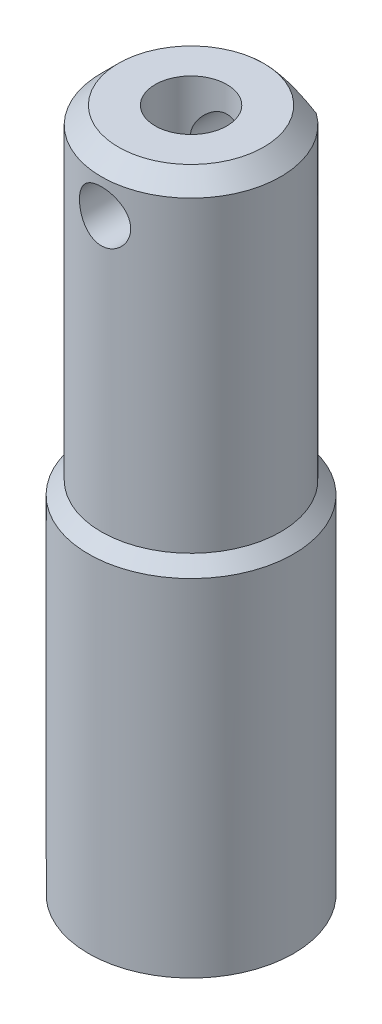
ISO-10303-21;
HEADER;
FILE_DESCRIPTION(('STEP AP214'),'2;1');
FILE_NAME('part.step','',(''),(''),'','','');
FILE_SCHEMA(('AUTOMOTIVE_DESIGN { 1 0 10303 214 1 1 1 1 }'));
ENDSEC;
DATA;
#1=APPLICATION_CONTEXT('core data for automotive mechanical design processes');
#2=APPLICATION_PROTOCOL_DEFINITION('international standard','automotive_design',2000,#1);
#3=PRODUCT_CONTEXT('',#1,'mechanical');
#4=PRODUCT('Part','Part','',(#3));
#5=PRODUCT_RELATED_PRODUCT_CATEGORY('part','',(#4));
#6=PRODUCT_DEFINITION_FORMATION('','',#4);
#7=PRODUCT_DEFINITION_CONTEXT('part definition',#1,'design');
#8=PRODUCT_DEFINITION('design','',#6,#7);
#9=PRODUCT_DEFINITION_SHAPE('','',#8);
#10=(LENGTH_UNIT() NAMED_UNIT(*) SI_UNIT(.MILLI.,.METRE.));
#11=(NAMED_UNIT(*) PLANE_ANGLE_UNIT() SI_UNIT($,.RADIAN.));
#12=(NAMED_UNIT(*) SI_UNIT($,.STERADIAN.) SOLID_ANGLE_UNIT());
#13=UNCERTAINTY_MEASURE_WITH_UNIT(LENGTH_MEASURE(1.E-05),#10,'distance_accuracy_value','');
#14=(GEOMETRIC_REPRESENTATION_CONTEXT(3) GLOBAL_UNCERTAINTY_ASSIGNED_CONTEXT((#13)) GLOBAL_UNIT_ASSIGNED_CONTEXT((#10,
#11,#12)) REPRESENTATION_CONTEXT('',''));
#15=CARTESIAN_POINT('',(0.,0.,0.));
#16=DIRECTION('',(0.,0.,1.));
#17=DIRECTION('',(1.,0.,0.));
#18=AXIS2_PLACEMENT_3D('',#15,#16,#17);
#19=CARTESIAN_POINT('',(0.,20.,0.));
#20=DIRECTION('',(0.,-1.,0.));
#21=DIRECTION('',(0.,0.,-1.));
#22=AXIS2_PLACEMENT_3D('',#19,#20,#21);
#23=CYLINDRICAL_SURFACE('',#22,6.);
#24=CARTESIAN_POINT('',(0.,20.25,0.));
#25=DIRECTION('',(0.,-1.,0.));
#26=DIRECTION('',(0.,0.,-1.));
#27=AXIS2_PLACEMENT_3D('',#24,#25,#26);
#28=CIRCLE('',#27,6.);
#29=CARTESIAN_POINT('',(0.,20.25,-6.));
#30=VERTEX_POINT('',#29);
#31=EDGE_CURVE('E11',#30,#30,#28,.T.);
#32=ORIENTED_EDGE('',*,*,#31,.T.);
#33=EDGE_LOOP('',(#32));
#34=FACE_BOUND('',#33,.T.);
#35=CARTESIAN_POINT('',(0.,0.,0.));
#36=DIRECTION('',(0.,1.,0.));
#37=DIRECTION('',(0.,0.,1.));
#38=AXIS2_PLACEMENT_3D('',#35,#36,#37);
#39=CIRCLE('',#38,6.);
#40=CARTESIAN_POINT('',(0.,0.,6.));
#41=VERTEX_POINT('',#40);
#42=EDGE_CURVE('E94',#41,#41,#39,.T.);
#43=ORIENTED_EDGE('',*,*,#42,.T.);
#44=EDGE_LOOP('',(#43));
#45=FACE_BOUND('',#44,.T.);
#46=ADVANCED_FACE('F36',(#34,#45),#23,.T.);
#47=CARTESIAN_POINT('',(0.,0.,0.));
#48=DIRECTION('',(0.,1.,0.));
#49=DIRECTION('',(0.,0.,1.));
#50=AXIS2_PLACEMENT_3D('',#47,#48,#49);
#51=PLANE('',#50);
#52=ORIENTED_EDGE('',*,*,#42,.F.);
#53=EDGE_LOOP('',(#52));
#54=FACE_BOUND('',#53,.T.);
#55=ADVANCED_FACE('F131',(#54),#51,.F.);
#56=CARTESIAN_POINT('',(0.,40.,0.));
#57=DIRECTION('',(0.,-1.,0.));
#58=DIRECTION('',(0.,0.,-1.));
#59=AXIS2_PLACEMENT_3D('',#56,#57,#58);
#60=CYLINDRICAL_SURFACE('',#59,5.25);
#61=CARTESIAN_POINT('',(0.,21.,0.));
#62=DIRECTION('',(0.,1.,0.));
#63=DIRECTION('',(0.,0.,1.));
#64=AXIS2_PLACEMENT_3D('',#61,#62,#63);
#65=CIRCLE('',#64,5.25);
#66=CARTESIAN_POINT('',(0.,21.,5.25));
#67=VERTEX_POINT('',#66);
#68=EDGE_CURVE('E153',#67,#67,#65,.T.);
#69=ORIENTED_EDGE('',*,*,#68,.T.);
#70=EDGE_LOOP('',(#69));
#71=FACE_BOUND('',#70,.T.);
#72=CARTESIAN_POINT('',(-1.5,37.,5.03115294937453));
#73=CARTESIAN_POINT('',(-1.49999851534795,37.0823886534079,5.03115410257281));
#74=CARTESIAN_POINT('',(-1.49318899949663,37.1647923131909,5.03319884759406));
#75=CARTESIAN_POINT('',(-1.46619272542646,37.3272034291472,5.04112791905326));
#76=CARTESIAN_POINT('',(-1.44600052602251,37.4072098968255,5.04701380722367));
#77=CARTESIAN_POINT('',(-1.3929700746965,37.5624529006536,5.06190532141159));
#78=CARTESIAN_POINT('',(-1.36015140488906,37.6376966138629,5.07090611443027));
#79=CARTESIAN_POINT('',(-1.28286273047203,37.7816258586658,5.09100690822109));
#80=CARTESIAN_POINT('',(-1.2383913424976,37.8503106102835,5.10210715818895));
#81=CARTESIAN_POINT('',(-1.13769360073649,37.9811436739861,5.12551337410616));
#82=CARTESIAN_POINT('',(-1.08119190834937,38.0430758515969,5.13784316973112));
#83=CARTESIAN_POINT('',(-0.958628434101954,38.1567270874778,5.16211474134013));
#84=CARTESIAN_POINT('',(-0.892565534369724,38.2084449498421,5.17405647175239));
#85=CARTESIAN_POINT('',(-0.751234524118192,38.3011214862651,5.19647499001134));
#86=CARTESIAN_POINT('',(-0.675818087821402,38.3418622148132,5.2069204087565));
#87=CARTESIAN_POINT('',(-0.518856356429732,38.410001330812,5.22489405364148));
#88=CARTESIAN_POINT('',(-0.437312258156382,38.4374023159302,5.23242284768149));
#89=CARTESIAN_POINT('',(-0.272668931340886,38.4773758459298,5.24354639475177));
#90=CARTESIAN_POINT('',(-0.189665848596783,38.4903167662785,5.24723870258477));
#91=CARTESIAN_POINT('',(-0.0225900768164462,38.5021650504124,5.2506157174477));
#92=CARTESIAN_POINT('',(0.0614824046914079,38.501075096753,5.25030119054237));
#93=CARTESIAN_POINT('',(0.225735146801412,38.4851452188115,5.2457700507248));
#94=CARTESIAN_POINT('',(0.305957659581706,38.4707037905215,5.24166653082038));
#95=CARTESIAN_POINT('',(0.46278916663321,38.4291286731517,5.23015414747603));
#96=CARTESIAN_POINT('',(0.539397940725379,38.4019942118034,5.22274508292168));
#97=CARTESIAN_POINT('',(0.687805375296692,38.3355179493911,5.20529273829083));
#98=CARTESIAN_POINT('',(0.759542282888079,38.2960459166437,5.195221541341));
#99=CARTESIAN_POINT('',(0.895505432692863,38.2061165602015,5.17352076730531));
#100=CARTESIAN_POINT('',(0.959730024312008,38.1556568292501,5.16189084893963));
#101=CARTESIAN_POINT('',(1.08122448641081,38.0430957170361,5.13784262264717));
#102=CARTESIAN_POINT('',(1.13817118318867,37.9806479247962,5.1254109702704));
#103=CARTESIAN_POINT('',(1.24086976181232,37.8469636811155,5.10152230340244));
#104=CARTESIAN_POINT('',(1.28662073533696,37.7757265172882,5.09006536804024));
#105=CARTESIAN_POINT('',(1.36592501989085,37.6257018366265,5.06936381110807));
#106=CARTESIAN_POINT('',(1.39937803341578,37.5468585812113,5.06013758203982));
#107=CARTESIAN_POINT('',(1.45244213622068,37.3843351273715,5.04516408290506));
#108=CARTESIAN_POINT('',(1.47205725302032,37.3006563440051,5.03941580065156));
#109=CARTESIAN_POINT('',(1.49630562899914,37.1338896817508,5.03226836397145));
#110=CARTESIAN_POINT('',(1.50142611118016,37.0508786373002,5.03072783487502));
#111=CARTESIAN_POINT('',(1.49789247539749,36.8851837630593,5.0317811969763));
#112=CARTESIAN_POINT('',(1.48924007568482,36.8024998937418,5.03437457244426));
#113=CARTESIAN_POINT('',(1.45883836069446,36.6417690789828,5.04326572540292));
#114=CARTESIAN_POINT('',(1.43739346638105,36.5636593104886,5.04947732224089));
#115=CARTESIAN_POINT('',(1.38236371399822,36.4121485960017,5.06481797948048));
#116=CARTESIAN_POINT('',(1.34877710420076,36.3387483312658,5.07394746083355));
#117=CARTESIAN_POINT('',(1.26946473841218,36.1967334435874,5.09437641007042));
#118=CARTESIAN_POINT('',(1.22345918796849,36.1282821668484,5.10572398035841));
#119=CARTESIAN_POINT('',(1.12095347763631,35.9998927199175,5.12920294912374));
#120=CARTESIAN_POINT('',(1.06445104326103,35.9399563997409,5.14133451710708));
#121=CARTESIAN_POINT('',(0.940281007474169,35.8282154362839,5.16551045577065));
#122=CARTESIAN_POINT('',(0.872300782680413,35.7767537714359,5.17753804534607));
#123=CARTESIAN_POINT('',(0.72838898029316,35.685965738963,5.19973482784499));
#124=CARTESIAN_POINT('',(0.652457818573638,35.6466387370582,5.20990411789059));
#125=CARTESIAN_POINT('',(0.495324954717124,35.5816117847302,5.22717378634804));
#126=CARTESIAN_POINT('',(0.414168599924726,35.5558087078104,5.23429731095436));
#127=CARTESIAN_POINT('',(0.248434236412442,35.5182798985449,5.24477504717914));
#128=CARTESIAN_POINT('',(0.163857113689078,35.506550544864,5.24813022842264));
#129=CARTESIAN_POINT('',(-0.00313367846927184,35.4977564245017,5.25064001252463));
#130=CARTESIAN_POINT('',(-0.0855192232874674,35.5001918881879,5.24993777691747));
#131=CARTESIAN_POINT('',(-0.248658879316503,35.5184787110577,5.24474301841601));
#132=CARTESIAN_POINT('',(-0.329413068463148,35.5343294277865,5.24025067702944));
#133=CARTESIAN_POINT('',(-0.48630309977969,35.5786985207341,5.22801601395087));
#134=CARTESIAN_POINT('',(-0.562473775076287,35.607102384208,5.22030310536131));
#135=CARTESIAN_POINT('',(-0.709010402071097,35.6756696187141,5.2024282060759));
#136=CARTESIAN_POINT('',(-0.779375452935512,35.7158348103192,5.19226583626338));
#137=CARTESIAN_POINT('',(-0.914575092265432,35.8081730030686,5.17019216580141));
#138=CARTESIAN_POINT('',(-0.979182996005302,35.8606675650913,5.15823784339672));
#139=CARTESIAN_POINT('',(-1.09884091673879,35.9755818440904,5.13408048739897));
#140=CARTESIAN_POINT('',(-1.15388828414235,36.0380043033136,5.12187738590337));
#141=CARTESIAN_POINT('',(-1.25430634521844,36.1729726877466,5.09823028157902));
#142=CARTESIAN_POINT('',(-1.29938487542695,36.2457414606276,5.08681463826367));
#143=CARTESIAN_POINT('',(-1.37660957714715,36.398141398986,5.0664633399873));
#144=CARTESIAN_POINT('',(-1.40876298663645,36.4777686933162,5.05752629789876));
#145=CARTESIAN_POINT('',(-1.45573900509351,36.6307402751745,5.04418844667444));
#146=CARTESIAN_POINT('',(-1.47229424986293,36.7035177610769,5.03934329125492));
#147=CARTESIAN_POINT('',(-1.49442455282772,36.8508595887639,5.03282527099894));
#148=CARTESIAN_POINT('',(-1.5000013438736,36.9254236466733,5.03115190552541));
#149=CARTESIAN_POINT('',(-1.5,37.,5.03115294937453));
#150=B_SPLINE_CURVE_WITH_KNOTS('',3,(#72,#73,#74,#75,#76,#77,#78,#79,#80,#81,#82,#83,#84,#85,
#86,#87,#88,#89,#90,#91,#92,#93,#94,#95,#96,#97,#98,#99,#100,#101,#102,#103,#104,#105,#106,#107,
#108,#109,#110,#111,#112,#113,#114,#115,#116,#117,#118,#119,#120,#121,#122,#123,#124,#125,#126,
#127,#128,#129,#130,#131,#132,#133,#134,#135,#136,#137,#138,#139,#140,#141,#142,#143,#144,#145,
#146,#147,#148,#149),.UNSPECIFIED.,.T.,.F.,(4,2,2,2,2,2,2,2,2,2,2,2,2,2,2,2,2,2,2,2,2,2,2,2,2,2,
2,2,2,2,2,2,2,2,2,2,2,2,4),(0.,0.24689125677296,0.493882957214146,0.740493137802328,
0.987132608255508,1.24017875404962,1.49325450928863,1.75103612260385,2.00876751763279,
2.25977175771556,2.51072800914313,2.75442778232566,2.99814238459891,3.24452177533869,
3.49095519888626,3.7460370951975,4.0011396797232,4.25827890472505,4.51534325844759,
4.76365772500111,5.01194121523837,5.25453967242384,5.49717314412031,5.74581004531786,
5.99450088465078,6.25159041282492,6.50866650063486,6.76375263973567,7.01877312807479,
7.26485173263045,7.51091855317931,7.75478559291908,7.99869040157418,8.24984826559029,
8.50107562436486,8.7589020931598,9.01658397911739,9.2400996664987,9.46358007110251),.UNSPECIFIED.);
#151=CARTESIAN_POINT('',(-1.5,37.,5.03115294937453));
#152=VERTEX_POINT('',#151);
#153=EDGE_CURVE('E85',#152,#152,#150,.T.);
#154=ORIENTED_EDGE('',*,*,#153,.T.);
#155=EDGE_LOOP('',(#154));
#156=FACE_BOUND('',#155,.T.);
#157=DIRECTION('',(0.,1.,0.));
#158=VECTOR('',#157,1.);
#159=CARTESIAN_POINT('',(3.08220700148449,28.,-4.25));
#160=LINE('',#159,#158);
#161=CARTESIAN_POINT('',(3.08220700148449,28.,-4.25));
#162=VERTEX_POINT('',#161);
#163=CARTESIAN_POINT('',(3.08220700148449,39.,-4.25));
#164=VERTEX_POINT('',#163);
#165=EDGE_CURVE('E92',#162,#164,#160,.T.);
#166=ORIENTED_EDGE('',*,*,#165,.T.);
#167=CARTESIAN_POINT('',(0.,39.,0.));
#168=DIRECTION('',(0.,1.,0.));
#169=DIRECTION('',(0.,0.,1.));
#170=AXIS2_PLACEMENT_3D('',#167,#168,#169);
#171=CIRCLE('',#170,5.25);
#172=CARTESIAN_POINT('',(-3.08220700148449,39.,-4.25));
#173=VERTEX_POINT('',#172);
#174=EDGE_CURVE('E44',#164,#173,#171,.F.);
#175=ORIENTED_EDGE('',*,*,#174,.T.);
#176=DIRECTION('',(0.,1.,0.));
#177=VECTOR('',#176,1.);
#178=CARTESIAN_POINT('',(-3.08220700148449,28.,-4.25));
#179=LINE('',#178,#177);
#180=CARTESIAN_POINT('',(-3.08220700148449,28.,-4.25));
#181=VERTEX_POINT('',#180);
#182=EDGE_CURVE('E91',#181,#173,#179,.T.);
#183=ORIENTED_EDGE('',*,*,#182,.F.);
#184=CARTESIAN_POINT('',(0.,28.,0.));
#185=DIRECTION('',(0.,1.,0.));
#186=DIRECTION('',(0.,0.,1.));
#187=AXIS2_PLACEMENT_3D('',#184,#185,#186);
#188=CIRCLE('',#187,5.25);
#189=EDGE_CURVE('E79',#162,#181,#188,.T.);
#190=ORIENTED_EDGE('',*,*,#189,.F.);
#191=EDGE_LOOP('',(#166,#175,#183,#190));
#192=FACE_BOUND('',#191,.T.);
#193=ADVANCED_FACE('F125',(#71,#156,#192),#60,.T.);
#194=CARTESIAN_POINT('',(0.,40.,0.));
#195=DIRECTION('',(0.,1.,0.));
#196=DIRECTION('',(0.,0.,1.));
#197=AXIS2_PLACEMENT_3D('',#194,#195,#196);
#198=PLANE('',#197);
#199=CARTESIAN_POINT('',(0.,40.,0.));
#200=DIRECTION('',(0.,1.,0.));
#201=DIRECTION('',(0.,0.,1.));
#202=AXIS2_PLACEMENT_3D('',#199,#200,#201);
#203=CIRCLE('',#202,4.25);
#204=CARTESIAN_POINT('',(0.,40.,-4.25));
#205=VERTEX_POINT('',#204);
#206=EDGE_CURVE('E98',#205,#205,#203,.T.);
#207=ORIENTED_EDGE('',*,*,#206,.T.);
#208=EDGE_LOOP('',(#207));
#209=FACE_BOUND('',#208,.T.);
#210=CARTESIAN_POINT('',(0.,40.,0.));
#211=DIRECTION('',(0.,1.,0.));
#212=DIRECTION('',(0.,0.,1.));
#213=AXIS2_PLACEMENT_3D('',#210,#211,#212);
#214=CIRCLE('',#213,2.1);
#215=CARTESIAN_POINT('',(0.,40.,2.1));
#216=VERTEX_POINT('',#215);
#217=EDGE_CURVE('E80',#216,#216,#214,.T.);
#218=ORIENTED_EDGE('',*,*,#217,.F.);
#219=EDGE_LOOP('',(#218));
#220=FACE_BOUND('',#219,.T.);
#221=ADVANCED_FACE('F130',(#209,#220),#198,.T.);
#222=CARTESIAN_POINT('',(-3.08220700148449,28.,-4.25));
#223=DIRECTION('',(0.,0.,1.));
#224=DIRECTION('',(1.,0.,0.));
#225=AXIS2_PLACEMENT_3D('',#222,#223,#224);
#226=PLANE('',#225);
#227=CARTESIAN_POINT('',(0.,37.,-4.25));
#228=DIRECTION('',(0.,0.,-1.));
#229=DIRECTION('',(-1.,0.,0.));
#230=AXIS2_PLACEMENT_3D('',#227,#228,#229);
#231=CIRCLE('',#230,1.5);
#232=CARTESIAN_POINT('',(-1.5,37.,-4.25));
#233=VERTEX_POINT('',#232);
#234=EDGE_CURVE('E107',#233,#233,#231,.T.);
#235=ORIENTED_EDGE('',*,*,#234,.F.);
#236=EDGE_LOOP('',(#235));
#237=FACE_BOUND('',#236,.T.);
#238=CARTESIAN_POINT('',(-3.08220700148449,39.,-4.25));
#239=CARTESIAN_POINT('',(-3.0063701603359,39.0445182820328,-4.25));
#240=CARTESIAN_POINT('',(-2.93006831491126,39.0882422805079,-4.25));
#241=CARTESIAN_POINT('',(-2.77643153423641,39.1738799842041,-4.25));
#242=CARTESIAN_POINT('',(-2.69909634587394,39.2157932348397,-4.25));
#243=CARTESIAN_POINT('',(-2.46491445662935,39.3387288340163,-4.25));
#244=CARTESIAN_POINT('',(-2.30640522289687,39.4166415274033,-4.25));
#245=CARTESIAN_POINT('',(-1.98858259772944,39.5598661096746,-4.25));
#246=CARTESIAN_POINT('',(-1.82939182660505,39.6254477253803,-4.25));
#247=CARTESIAN_POINT('',(-1.50634651678711,39.7434433555469,-4.25));
#248=CARTESIAN_POINT('',(-1.34249911394454,39.7958764230781,-4.25));
#249=CARTESIAN_POINT('',(-1.08130436749482,39.8655618602511,-4.25));
#250=CARTESIAN_POINT('',(-0.985404512816414,39.8882803809539,-4.25));
#251=CARTESIAN_POINT('',(-0.792384764386069,39.9277956953645,-4.25));
#252=CARTESIAN_POINT('',(-0.695264960443363,39.944592922366,-4.25));
#253=CARTESIAN_POINT('',(-0.498745804538502,39.9719543557624,-4.25));
#254=CARTESIAN_POINT('',(-0.39933362024921,39.9824273238007,-4.25));
#255=CARTESIAN_POINT('',(-0.199954070272676,39.9964726533747,-4.25));
#256=CARTESIAN_POINT('',(-0.0999863562874619,40.0000400393217,-4.25));
#257=CARTESIAN_POINT('',(0.,40.,-4.25));
#258=B_SPLINE_CURVE_WITH_KNOTS('',3,(#238,#239,#240,#241,#242,#243,#244,#245,#246,#247,#248,
#249,#250,#251,#252,#253,#254,#255,#256,#257),.UNSPECIFIED.,.F.,.F.,(4,2,2,2,2,2,2,2,2,4),(0.,
0.263804043656459,0.527673934566439,1.05720503683108,1.57329018194224,2.08862310881886,
2.38412748876099,2.67961024053117,2.97925988548073,3.27912535282511),.UNSPECIFIED.);
#259=EDGE_CURVE('E144',#173,#205,#258,.T.);
#260=ORIENTED_EDGE('',*,*,#259,.T.);
#261=CARTESIAN_POINT('',(0.,40.,-4.25));
#262=CARTESIAN_POINT('',(0.0653269705590216,40.0000052576683,-4.25));
#263=CARTESIAN_POINT('',(0.13064423570968,39.9984930313468,-4.25));
#264=CARTESIAN_POINT('',(0.261131064735354,39.9924830596894,-4.25));
#265=CARTESIAN_POINT('',(0.326300650693151,39.9879857949662,-4.25));
#266=CARTESIAN_POINT('',(0.521152384573401,39.9701150445716,-4.25));
#267=CARTESIAN_POINT('',(0.650454355991038,39.9523621832319,-4.25));
#268=CARTESIAN_POINT('',(0.904956250359105,39.9064979173804,-4.25));
#269=CARTESIAN_POINT('',(1.03018865635995,39.8785621474672,-4.25));
#270=CARTESIAN_POINT('',(1.27828420427429,39.8135410018351,-4.25));
#271=CARTESIAN_POINT('',(1.40114635051383,39.7764518675709,-4.25));
#272=CARTESIAN_POINT('',(1.65777124024803,39.6898992993084,-4.25));
#273=CARTESIAN_POINT('',(1.79122132431231,39.6395170773918,-4.25));
#274=CARTESIAN_POINT('',(2.0548723678893,39.5308293023631,-4.25));
#275=CARTESIAN_POINT('',(2.1850722001696,39.4725210443658,-4.25));
#276=CARTESIAN_POINT('',(2.44490104728183,39.3482927252294,-4.25));
#277=CARTESIAN_POINT('',(2.57446884789548,39.2822458643508,-4.25));
#278=CARTESIAN_POINT('',(2.8305209965574,39.1448243310907,-4.25));
#279=CARTESIAN_POINT('',(2.95700945433946,39.0734573421309,-4.25));
#280=CARTESIAN_POINT('',(3.08220700148449,39.,-4.25));
#281=B_SPLINE_CURVE_WITH_KNOTS('',3,(#261,#262,#263,#264,#265,#266,#267,#268,#269,#270,#271,
#272,#273,#274,#275,#276,#277,#278,#279,#280),.UNSPECIFIED.,.F.,.F.,(4,2,2,2,2,2,2,2,2,4),(0.,
0.195944861766853,0.391858182651325,0.782857410641365,1.16740924493426,1.55211924700794,
1.97973894049338,2.40750493405806,2.84365579152382,3.27918852057569),.UNSPECIFIED.);
#282=EDGE_CURVE('E58',#205,#164,#281,.T.);
#283=ORIENTED_EDGE('',*,*,#282,.T.);
#284=ORIENTED_EDGE('',*,*,#165,.F.);
#285=DIRECTION('',(1.,0.,0.));
#286=VECTOR('',#285,1.);
#287=CARTESIAN_POINT('',(-3.08220700148449,28.,-4.25));
#288=LINE('',#287,#286);
#289=EDGE_CURVE('E82',#181,#162,#288,.T.);
#290=ORIENTED_EDGE('',*,*,#289,.F.);
#291=ORIENTED_EDGE('',*,*,#182,.T.);
#292=EDGE_LOOP('',(#260,#283,#284,#290,#291));
#293=FACE_BOUND('',#292,.T.);
#294=ADVANCED_FACE('F154',(#237,#293),#226,.F.);
#295=CARTESIAN_POINT('',(0.,28.,0.));
#296=DIRECTION('',(0.,1.,0.));
#297=DIRECTION('',(0.,0.,1.));
#298=AXIS2_PLACEMENT_3D('',#295,#296,#297);
#299=PLANE('',#298);
#300=ORIENTED_EDGE('',*,*,#189,.T.);
#301=ORIENTED_EDGE('',*,*,#289,.T.);
#302=EDGE_LOOP('',(#300,#301));
#303=FACE_BOUND('',#302,.T.);
#304=ADVANCED_FACE('F73',(#303),#299,.T.);
#305=CARTESIAN_POINT('',(0.,26.,0.));
#306=DIRECTION('',(0.,1.,0.));
#307=DIRECTION('',(0.,0.,1.));
#308=AXIS2_PLACEMENT_3D('',#305,#306,#307);
#309=CONICAL_SURFACE('',#308,2.1,1.02974425867665);
#310=CARTESIAN_POINT('',(0.,24.7381927000421,0.));
#311=VERTEX_POINT('',#310);
#312=VERTEX_LOOP('',#311);
#313=FACE_BOUND('',#312,.T.);
#314=CARTESIAN_POINT('',(0.,26.,0.));
#315=DIRECTION('',(0.,1.,0.));
#316=DIRECTION('',(0.,0.,1.));
#317=AXIS2_PLACEMENT_3D('',#314,#315,#316);
#318=CIRCLE('',#317,2.1);
#319=CARTESIAN_POINT('',(0.,26.,2.1));
#320=VERTEX_POINT('',#319);
#321=EDGE_CURVE('E77',#320,#320,#318,.T.);
#322=ORIENTED_EDGE('',*,*,#321,.T.);
#323=EDGE_LOOP('',(#322));
#324=FACE_BOUND('',#323,.T.);
#325=ADVANCED_FACE('F69',(#313,#324),#309,.F.);
#326=CARTESIAN_POINT('',(0.,40.,0.));
#327=DIRECTION('',(0.,1.,0.));
#328=DIRECTION('',(0.,0.,1.));
#329=AXIS2_PLACEMENT_3D('',#326,#327,#328);
#330=CYLINDRICAL_SURFACE('',#329,2.1);
#331=CARTESIAN_POINT('',(0.,35.5,2.1));
#332=CARTESIAN_POINT('',(0.074239987154313,35.4999983328154,2.10000151369632));
#333=CARTESIAN_POINT('',(0.148472287801961,35.5055423787794,2.0960305657222));
#334=CARTESIAN_POINT('',(0.294537510569104,35.5273475251038,2.0805400757946));
#335=CARTESIAN_POINT('',(0.366369374426851,35.5436132884446,2.06901724946753));
#336=CARTESIAN_POINT('',(0.505280759912231,35.585807308767,2.03953798236432));
#337=CARTESIAN_POINT('',(0.572382093189154,35.6116872220812,2.02161374748366));
#338=CARTESIAN_POINT('',(0.700940346431814,35.671945724954,1.98071681938223));
#339=CARTESIAN_POINT('',(0.762396508800773,35.7063254529312,1.95774344995381));
#340=CARTESIAN_POINT('',(0.884158454498676,35.7859073516989,1.90604858079968));
#341=CARTESIAN_POINT('',(0.943867292555758,35.8318033956452,1.87699641663021));
#342=CARTESIAN_POINT('',(1.05527082397682,35.9313580286347,1.81670725523486));
#343=CARTESIAN_POINT('',(1.10695327031244,35.9850282433377,1.78546702271466));
#344=CARTESIAN_POINT('',(1.21060137903401,36.1099438614266,1.71725277223226));
#345=CARTESIAN_POINT('',(1.26087106387615,36.1826062344538,1.6802808930462));
#346=CARTESIAN_POINT('',(1.34855873776776,36.3372329019045,1.61074875287382));
#347=CARTESIAN_POINT('',(1.38599721054951,36.4191820898905,1.57818151113001));
#348=CARTESIAN_POINT('',(1.43652136520738,36.5638355165509,1.53205163132705));
#349=CARTESIAN_POINT('',(1.45356662497443,36.6242701001125,1.51574445703128));
#350=CARTESIAN_POINT('',(1.48005230154604,36.7481312598627,1.48989690052004));
#351=CARTESIAN_POINT('',(1.48950884665266,36.8115511857637,1.48034217251357));
#352=CARTESIAN_POINT('',(1.50020552985074,36.9402391816524,1.46950664613977));
#353=CARTESIAN_POINT('',(1.50139229875544,37.0055165312642,1.46827959192339));
#354=CARTESIAN_POINT('',(1.49530198035969,37.1352791024719,1.47447819447096));
#355=CARTESIAN_POINT('',(1.48801790144054,37.1997636252687,1.48191099886764));
#356=CARTESIAN_POINT('',(1.46411936401694,37.3340474341866,1.50554403866107));
#357=CARTESIAN_POINT('',(1.44643072329693,37.4034716403027,1.52274402363615));
#358=CARTESIAN_POINT('',(1.4021917385744,37.5374588371673,1.56357256020827));
#359=CARTESIAN_POINT('',(1.37562175610307,37.6020106628682,1.58721533654268));
#360=CARTESIAN_POINT('',(1.30511742817235,37.7448735997179,1.64601588118791));
#361=CARTESIAN_POINT('',(1.25835357558366,37.8212487194466,1.68247147274397));
#362=CARTESIAN_POINT('',(1.15248477752395,37.9642087692087,1.7566939000375));
#363=CARTESIAN_POINT('',(1.09336770173585,38.0307839658066,1.79446199397487));
#364=CARTESIAN_POINT('',(0.962800834327982,38.1537461025634,1.86780118446223));
#365=CARTESIAN_POINT('',(0.891235370375016,38.2100263003869,1.90334699446249));
#366=CARTESIAN_POINT('',(0.737122627440586,38.3095868466926,1.96814501690765));
#367=CARTESIAN_POINT('',(0.654601115677314,38.3528969440433,1.99741158728469));
#368=CARTESIAN_POINT('',(0.502786762492044,38.4149591141148,2.04003552659874));
#369=CARTESIAN_POINT('',(0.435502933372752,38.4371586283004,2.05554723038274));
#370=CARTESIAN_POINT('',(0.297347607907097,38.4719529373133,2.08002166700399));
#371=CARTESIAN_POINT('',(0.22647875868259,38.4845547116779,2.08898915863501));
#372=CARTESIAN_POINT('',(0.082880813057716,38.4994521079923,2.09960209594908));
#373=CARTESIAN_POINT('',(0.010146545777707,38.5017150354395,2.10122431355104));
#374=CARTESIAN_POINT('',(-0.13466214450759,38.4956998283681,2.09692955045279));
#375=CARTESIAN_POINT('',(-0.206736496598432,38.4874205740719,2.09101176886313));
#376=CARTESIAN_POINT('',(-0.344652982451693,38.4614742561572,2.07263811534357));
#377=CARTESIAN_POINT('',(-0.410628443822311,38.4442731782697,2.06050712104556));
#378=CARTESIAN_POINT('',(-0.538540725972057,38.4016147128666,2.03083469907945));
#379=CARTESIAN_POINT('',(-0.600476724637231,38.3761556509397,2.0132921741901));
#380=CARTESIAN_POINT('',(-0.724729922862123,38.3152870706117,1.97216386451728));
#381=CARTESIAN_POINT('',(-0.786570692260161,38.2791837539811,1.94817387755704));
#382=CARTESIAN_POINT('',(-0.90357566486908,38.1994056236057,1.89674553679489));
#383=CARTESIAN_POINT('',(-0.958734635088287,38.1557249397661,1.86930451408401));
#384=CARTESIAN_POINT('',(-1.07130953790489,38.053139475002,1.80751918651238));
#385=CARTESIAN_POINT('',(-1.12732700599567,37.9929101524552,1.7728243678149));
#386=CARTESIAN_POINT('',(-1.22898063188699,37.8639189512719,1.7039290476612));
#387=CARTESIAN_POINT('',(-1.27461125255647,37.7951525516436,1.66972881892081));
#388=CARTESIAN_POINT('',(-1.34840655881999,37.6608502607182,1.61049068369464));
#389=CARTESIAN_POINT('',(-1.3781826574188,37.5964683129876,1.58485448207673));
#390=CARTESIAN_POINT('',(-1.42875227353067,37.4623595209991,1.5394240379246));
#391=CARTESIAN_POINT('',(-1.44956479313557,37.3926443561844,1.51961746555233));
#392=CARTESIAN_POINT('',(-1.47808233463791,37.2623907137056,1.49184341447737));
#393=CARTESIAN_POINT('',(-1.48750670349303,37.2025615644356,1.4823579407629));
#394=CARTESIAN_POINT('',(-1.49901279618901,37.0815181759182,1.47072540809102));
#395=CARTESIAN_POINT('',(-1.50110270525938,37.02030555748,1.46857016870271));
#396=CARTESIAN_POINT('',(-1.49779304937287,36.8983049277164,1.47194411498406));
#397=CARTESIAN_POINT('',(-1.49239297729272,36.8375169454218,1.47747382097746));
#398=CARTESIAN_POINT('',(-1.47449551867843,36.7179915614626,1.49533169466967));
#399=CARTESIAN_POINT('',(-1.46198715244103,36.6592574816607,1.50767037888344));
#400=CARTESIAN_POINT('',(-1.42521014636684,36.5255757861049,1.54259872476081));
#401=CARTESIAN_POINT('',(-1.39839283351164,36.4518773488908,1.56724515694173));
#402=CARTESIAN_POINT('',(-1.33469997861311,36.3111086032865,1.62183051991131));
#403=CARTESIAN_POINT('',(-1.2978077170184,36.2440495674089,1.65177821892023));
#404=CARTESIAN_POINT('',(-1.21375615645452,36.1152034119194,1.71453266330322));
#405=CARTESIAN_POINT('',(-1.1663473765118,36.0536066242369,1.74739464555718));
#406=CARTESIAN_POINT('',(-1.06240230609338,35.9382412767377,1.81247541609042));
#407=CARTESIAN_POINT('',(-1.00586287927557,35.884475418928,1.84469397906931));
#408=CARTESIAN_POINT('',(-0.873603136327677,35.7771946746661,1.91133354237187));
#409=CARTESIAN_POINT('',(-0.796256196228738,35.7252991560306,1.94518702963912));
#410=CARTESIAN_POINT('',(-0.630875696670561,35.6358952974295,2.00491356473176));
#411=CARTESIAN_POINT('',(-0.542860755389257,35.5983623541869,2.03080024477001));
#412=CARTESIAN_POINT('',(-0.379081513008413,35.5467359694778,2.06681366995399));
#413=CARTESIAN_POINT('',(-0.304852347827535,35.5293102628379,2.07914974133551));
#414=CARTESIAN_POINT('',(-0.153744270008503,35.505948741211,2.09573818287287));
#415=CARTESIAN_POINT('',(-0.0768680148396463,35.5000017262014,2.09999843272021));
#416=CARTESIAN_POINT('',(0.,35.5,2.1));
#417=B_SPLINE_CURVE_WITH_KNOTS('',3,(#331,#332,#333,#334,#335,#336,#337,#338,#339,#340,#341,
#342,#343,#344,#345,#346,#347,#348,#349,#350,#351,#352,#353,#354,#355,#356,#357,#358,#359,#360,
#361,#362,#363,#364,#365,#366,#367,#368,#369,#370,#371,#372,#373,#374,#375,#376,#377,#378,#379,
#380,#381,#382,#383,#384,#385,#386,#387,#388,#389,#390,#391,#392,#393,#394,#395,#396,#397,#398,
#399,#400,#401,#402,#403,#404,#405,#406,#407,#408,#409,#410,#411,#412,#413,#414,#415,#416),
.UNSPECIFIED.,.T.,.F.,(4,2,2,2,2,2,2,2,2,2,2,2,2,2,2,2,2,2,2,2,2,2,2,2,2,2,2,2,2,2,2,2,2,2,2,2,
2,2,2,2,2,2,4),(0.,0.222407137033425,0.444911064992704,0.666310976308097,0.887740556796047,
1.12901917175521,1.37066239795699,1.65674641323184,1.94237157348726,2.13628403403778,
2.32978327261918,2.52453011590944,2.7194378123579,2.93927374942447,3.15959904043211,
3.44820788194631,3.73710146762559,4.02883886432738,4.3199019003358,4.53657909767287,
4.7530985751299,4.97030227966832,5.18752905724045,5.39440800172807,5.60132891979958,
5.82704593329479,6.05293859435067,6.31971670046752,6.58663669215809,6.81214633204463,
7.03717552727383,7.22029125711348,7.40320256538925,7.58612625862381,7.76933327276094,
8.01461476402194,8.2603058040042,8.51260573354359,8.7649925121998,9.06059540426994,
9.35568963348345,9.58619480297343,9.81647494936399),.UNSPECIFIED.);
#418=CARTESIAN_POINT('',(0.,35.5,2.1));
#419=VERTEX_POINT('',#418);
#420=EDGE_CURVE('E106',#419,#419,#417,.T.);
#421=ORIENTED_EDGE('',*,*,#420,.T.);
#422=EDGE_LOOP('',(#421));
#423=FACE_BOUND('',#422,.T.);
#424=CARTESIAN_POINT('',(-1.5,37.,-1.4696938456699));
#425=CARTESIAN_POINT('',(-1.50000136654578,37.0714635636139,-1.46969165930967));
#426=CARTESIAN_POINT('',(-1.49484568464259,37.1429207403161,-1.47500932637415));
#427=CARTESIAN_POINT('',(-1.47474413498796,37.2831501533783,-1.49509778142078));
#428=CARTESIAN_POINT('',(-1.45977416663717,37.3519153374449,-1.50989183818347));
#429=CARTESIAN_POINT('',(-1.4213704345725,37.484150557969,-1.54608690956729));
#430=CARTESIAN_POINT('',(-1.39803790596236,37.5476732010484,-1.56740847183024));
#431=CARTESIAN_POINT('',(-1.34384442045294,37.6697344167392,-1.61411338226233));
#432=CARTESIAN_POINT('',(-1.31298375674207,37.7282731833312,-1.63949657223533));
#433=CARTESIAN_POINT('',(-1.23801434968527,37.8505097655526,-1.69703920681542));
#434=CARTESIAN_POINT('',(-1.19251231937905,37.9131709629903,-1.72958548266557));
#435=CARTESIAN_POINT('',(-1.09234569430987,38.0309030748407,-1.79453481625315));
#436=CARTESIAN_POINT('',(-1.03766897496789,38.0859637671572,-1.82693762546));
#437=CARTESIAN_POINT('',(-0.909114118883182,38.1966278927636,-1.89464454418694));
#438=CARTESIAN_POINT('',(-0.833550251339787,38.2506089564553,-1.92945000277545));
#439=CARTESIAN_POINT('',(-0.671471184072273,38.3445616887617,-1.99163539004081));
#440=CARTESIAN_POINT('',(-0.58497954146143,38.3845628155065,-2.01903090484713));
#441=CARTESIAN_POINT('',(-0.428823654563353,38.4390714423056,-2.0568573791985));
#442=CARTESIAN_POINT('',(-0.361173149474215,38.457575484144,-2.06988765494728));
#443=CARTESIAN_POINT('',(-0.223037025629704,38.484991166103,-2.08928275459016));
#444=CARTESIAN_POINT('',(-0.152553773410153,38.4939106473936,-2.09565302694576));
#445=CARTESIAN_POINT('',(-0.0105972322099177,38.5016496965512,-2.10117694036723));
#446=CARTESIAN_POINT('',(0.0608778365420134,38.5004478466291,-2.10031527792017));
#447=CARTESIAN_POINT('',(0.202492055658253,38.4879691760126,-2.09141900536097));
#448=CARTESIAN_POINT('',(0.272630844890623,38.4766896701791,-2.08338248354529));
#449=CARTESIAN_POINT('',(0.40781619816932,38.4451239567931,-2.06113132668599));
#450=CARTESIAN_POINT('',(0.472947719355304,38.4250793700523,-2.04708263262734));
#451=CARTESIAN_POINT('',(0.598759663359001,38.376963329099,-2.01388317467698));
#452=CARTESIAN_POINT('',(0.659439177610696,38.3488902421232,-1.99473137301589));
#453=CARTESIAN_POINT('',(0.781979515918923,38.2821488941787,-1.95018428161982));
#454=CARTESIAN_POINT('',(0.843217563738518,38.242648244554,-1.92433092548092));
#455=CARTESIAN_POINT('',(0.958546642695746,38.1560275902243,-1.86956492969857));
#456=CARTESIAN_POINT('',(1.01263032520683,38.1088998601011,-1.84064919856859));
#457=CARTESIAN_POINT('',(1.12253959533403,37.9985214290082,-1.77613984520874));
#458=CARTESIAN_POINT('',(1.17684653076829,37.9339002110004,-1.74029823421898));
#459=CARTESIAN_POINT('',(1.27426961124232,37.7958482268797,-1.6702779134661));
#460=CARTESIAN_POINT('',(1.31738637558721,37.7224179486216,-1.63609911176211));
#461=CARTESIAN_POINT('',(1.38295023832981,37.5847012905478,-1.58077772002181));
#462=CARTESIAN_POINT('',(1.40786555789214,37.5220812754251,-1.55843290737092));
#463=CARTESIAN_POINT('',(1.44936824251929,37.3923666770235,-1.51991323882907));
#464=CARTESIAN_POINT('',(1.46597102346706,37.3252806399897,-1.50372697519069));
#465=CARTESIAN_POINT('',(1.48995559401033,37.1870650724588,-1.47997847836867));
#466=CARTESIAN_POINT('',(1.49722823022055,37.1158976759758,-1.47251842056757));
#467=CARTESIAN_POINT('',(1.50145580341694,36.9729509624099,-1.46821177064601));
#468=CARTESIAN_POINT('',(1.49841809338555,36.9011721178168,-1.47135761475232));
#469=CARTESIAN_POINT('',(1.48365443178123,36.7711657218678,-1.4862179505167));
#470=CARTESIAN_POINT('',(1.47337792994044,36.7125897811243,-1.4964991965727));
#471=CARTESIAN_POINT('',(1.44638320728363,36.5982114735756,-1.52260578901431));
#472=CARTESIAN_POINT('',(1.42965740459434,36.5424124588593,-1.5384376587824));
#473=CARTESIAN_POINT('',(1.38097343084556,36.408243566708,-1.58254090823626));
#474=CARTESIAN_POINT('',(1.34555737538805,36.3318968007285,-1.61313549796305));
#475=CARTESIAN_POINT('',(1.26349530316509,36.1872776876105,-1.67819313243432));
#476=CARTESIAN_POINT('',(1.21682680768474,36.1190219159808,-1.7126638459153));
#477=CARTESIAN_POINT('',(1.11187674670804,35.9896444385998,-1.78263899408259));
#478=CARTESIAN_POINT('',(1.05335590564385,35.9287195316445,-1.81814914820306));
#479=CARTESIAN_POINT('',(0.925990119024755,35.8169093019218,-1.88619820976558));
#480=CARTESIAN_POINT('',(0.857159635254358,35.766010143529,-1.91874117814134));
#481=CARTESIAN_POINT('',(0.720862070620281,35.6825173160365,-1.97355695532265));
#482=CARTESIAN_POINT('',(0.654701792827865,35.6483291724235,-1.99663695745858));
#483=CARTESIAN_POINT('',(0.516456587915705,35.5897171605615,-2.03677203003264));
#484=CARTESIAN_POINT('',(0.444375059484984,35.5652877375508,-2.05383052732655));
#485=CARTESIAN_POINT('',(0.295508306422651,35.5273813967837,-2.08048595093179));
#486=CARTESIAN_POINT('',(0.21869612121018,35.5139750083805,-2.0900348112284));
#487=CARTESIAN_POINT('',(0.0633454501597133,35.4993123233693,-2.10048455576968));
#488=CARTESIAN_POINT('',(-0.0151921045078585,35.498049626869,-2.10138999521387));
#489=CARTESIAN_POINT('',(-0.162689602153916,35.5072173341615,-2.09484940357417));
#490=CARTESIAN_POINT('',(-0.231772127939226,35.5164062433253,-2.08829003391129));
#491=CARTESIAN_POINT('',(-0.367128348695355,35.54398184017,-2.06879045843108));
#492=CARTESIAN_POINT('',(-0.43340156512774,35.5623700880937,-2.05584917022158));
#493=CARTESIAN_POINT('',(-0.563173310350384,35.607993665386,-2.02420489180259));
#494=CARTESIAN_POINT('',(-0.626569976308353,35.6354268252546,-2.00537359742542));
#495=CARTESIAN_POINT('',(-0.747870090713466,35.6979433720807,-1.96336858423814));
#496=CARTESIAN_POINT('',(-0.805772522435605,35.7330281710508,-1.94019406405214));
#497=CARTESIAN_POINT('',(-0.923986959254903,35.815841562924,-1.88707875962305));
#498=CARTESIAN_POINT('',(-0.983294495655123,35.864685505515,-1.85664563422285));
#499=CARTESIAN_POINT('',(-1.09343208886036,35.9703187138756,-1.79399906606274));
#500=CARTESIAN_POINT('',(-1.14424604653129,36.0271227012663,-1.7617823930885));
#501=CARTESIAN_POINT('',(-1.24487931564332,36.1584199117438,-1.69251482816941));
#502=CARTESIAN_POINT('',(-1.29302213478839,36.2342749797693,-1.65558627022477));
#503=CARTESIAN_POINT('',(-1.37574602319546,36.3954416102156,-1.58751047818563));
#504=CARTESIAN_POINT('',(-1.41035128558088,36.4807359502616,-1.55635298353238));
#505=CARTESIAN_POINT('',(-1.45748481316447,36.6383474061181,-1.51212917512404));
#506=CARTESIAN_POINT('',(-1.4733040147164,36.7089374180377,-1.49652391532486));
#507=CARTESIAN_POINT('',(-1.49454455651674,36.8530271370525,-1.47532311152695));
#508=CARTESIAN_POINT('',(-1.49999859483696,36.9265169450203,-1.46969609381457));
#509=CARTESIAN_POINT('',(-1.5,37.,-1.4696938456699));
#510=B_SPLINE_CURVE_WITH_KNOTS('',3,(#424,#425,#426,#427,#428,#429,#430,#431,#432,#433,#434,
#435,#436,#437,#438,#439,#440,#441,#442,#443,#444,#445,#446,#447,#448,#449,#450,#451,#452,#453,
#454,#455,#456,#457,#458,#459,#460,#461,#462,#463,#464,#465,#466,#467,#468,#469,#470,#471,#472,
#473,#474,#475,#476,#477,#478,#479,#480,#481,#482,#483,#484,#485,#486,#487,#488,#489,#490,#491,
#492,#493,#494,#495,#496,#497,#498,#499,#500,#501,#502,#503,#504,#505,#506,#507,#508,#509),
.UNSPECIFIED.,.T.,.F.,(4,2,2,2,2,2,2,2,2,2,2,2,2,2,2,2,2,2,2,2,2,2,2,2,2,2,2,2,2,2,2,2,2,2,2,2,
2,2,2,2,2,2,4),(0.,0.214041341565717,0.428610275712224,0.640664871601881,0.852711210197107,
1.10382573355409,1.35527476295181,1.65114310955597,1.94638419755254,2.15947902773155,
2.37239939108385,2.58577042909476,2.79919833566904,3.00708108528783,3.21500614230806,
3.44611668475213,3.67746279969139,3.95147971727035,4.22548146651264,4.43776026411787,
4.64964391165513,4.86398443491503,5.07817213005317,5.25849876334787,5.43903804027733,
5.7062421840404,5.97398460292702,6.24779650448652,6.52122785421021,6.75417807949531,
6.98699551758328,7.2212912614332,7.45546352144079,7.66448115880019,7.87353425836431,
8.08750217454552,8.3015096092438,8.54850648356668,8.79596634520379,9.08601786485975,
9.37554863589211,9.59633624226795,9.81642618565758),.UNSPECIFIED.);
#511=CARTESIAN_POINT('',(-1.5,37.,-1.4696938456699));
#512=VERTEX_POINT('',#511);
#513=EDGE_CURVE('E99',#512,#512,#510,.T.);
#514=ORIENTED_EDGE('',*,*,#513,.T.);
#515=EDGE_LOOP('',(#514));
#516=FACE_BOUND('',#515,.T.);
#517=ORIENTED_EDGE('',*,*,#321,.F.);
#518=EDGE_LOOP('',(#517));
#519=FACE_BOUND('',#518,.T.);
#520=ORIENTED_EDGE('',*,*,#217,.T.);
#521=EDGE_LOOP('',(#520));
#522=FACE_BOUND('',#521,.T.);
#523=ADVANCED_FACE('F72',(#423,#516,#519,#522),#330,.F.);
#524=CARTESIAN_POINT('',(0.,37.,6.));
#525=DIRECTION('',(0.,0.,-1.));
#526=DIRECTION('',(-1.,0.,0.));
#527=AXIS2_PLACEMENT_3D('',#524,#525,#526);
#528=CYLINDRICAL_SURFACE('',#527,1.5);
#529=ORIENTED_EDGE('',*,*,#234,.T.);
#530=EDGE_LOOP('',(#529));
#531=FACE_BOUND('',#530,.T.);
#532=ORIENTED_EDGE('',*,*,#513,.F.);
#533=EDGE_LOOP('',(#532));
#534=FACE_BOUND('',#533,.T.);
#535=ADVANCED_FACE('F116',(#531,#534),#528,.F.);
#536=ORIENTED_EDGE('',*,*,#420,.F.);
#537=EDGE_LOOP('',(#536));
#538=FACE_BOUND('',#537,.T.);
#539=ORIENTED_EDGE('',*,*,#153,.F.);
#540=EDGE_LOOP('',(#539));
#541=FACE_BOUND('',#540,.T.);
#542=ADVANCED_FACE('F112',(#538,#541),#528,.F.);
#543=CARTESIAN_POINT('',(0.,40.,0.));
#544=DIRECTION('',(0.,-1.,0.));
#545=DIRECTION('',(0.,0.,-1.));
#546=AXIS2_PLACEMENT_3D('',#543,#544,#545);
#547=CONICAL_SURFACE('',#546,4.25,0.785398163397446);
#548=ORIENTED_EDGE('',*,*,#259,.F.);
#549=ORIENTED_EDGE('',*,*,#174,.F.);
#550=ORIENTED_EDGE('',*,*,#282,.F.);
#551=ORIENTED_EDGE('',*,*,#206,.F.);
#552=EDGE_LOOP('',(#548,#549,#550,#551));
#553=FACE_BOUND('',#552,.T.);
#554=ADVANCED_FACE('F115',(#553),#547,.T.);
#555=CARTESIAN_POINT('',(0.,21.,0.));
#556=DIRECTION('',(0.,-1.,0.));
#557=DIRECTION('',(0.,0.,-1.));
#558=AXIS2_PLACEMENT_3D('',#555,#556,#557);
#559=CONICAL_SURFACE('',#558,5.25,0.785398163397443);
#560=ORIENTED_EDGE('',*,*,#31,.F.);
#561=EDGE_LOOP('',(#560));
#562=FACE_BOUND('',#561,.T.);
#563=ORIENTED_EDGE('',*,*,#68,.F.);
#564=EDGE_LOOP('',(#563));
#565=FACE_BOUND('',#564,.T.);
#566=ADVANCED_FACE('F38',(#562,#565),#559,.T.);
#567=CLOSED_SHELL('',(#46,#55,#193,#221,#294,#304,#325,#523,#535,#542,#554,#566));
#568=MANIFOLD_SOLID_BREP('B2',#567);
#569=ADVANCED_BREP_SHAPE_REPRESENTATION('',(#18,#568),#14);
#570=SHAPE_DEFINITION_REPRESENTATION(#9,#569);
ENDSEC;
END-ISO-10303-21;
